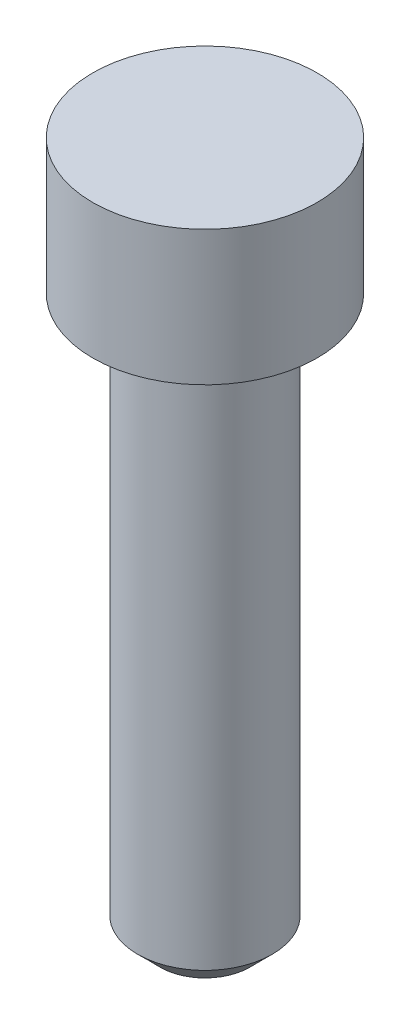
ISO-10303-21;
HEADER;
FILE_DESCRIPTION(('STEP AP214'),'2;1');
FILE_NAME('part.step','',(''),(''),'','','');
FILE_SCHEMA(('AUTOMOTIVE_DESIGN { 1 0 10303 214 1 1 1 1 }'));
ENDSEC;
DATA;
#1=APPLICATION_CONTEXT('core data for automotive mechanical design processes');
#2=APPLICATION_PROTOCOL_DEFINITION('international standard','automotive_design',2000,#1);
#3=PRODUCT_CONTEXT('',#1,'mechanical');
#4=PRODUCT('Part','Part','',(#3));
#5=PRODUCT_RELATED_PRODUCT_CATEGORY('part','',(#4));
#6=PRODUCT_DEFINITION_FORMATION('','',#4);
#7=PRODUCT_DEFINITION_CONTEXT('part definition',#1,'design');
#8=PRODUCT_DEFINITION('design','',#6,#7);
#9=PRODUCT_DEFINITION_SHAPE('','',#8);
#10=(LENGTH_UNIT() NAMED_UNIT(*) SI_UNIT(.MILLI.,.METRE.));
#11=(NAMED_UNIT(*) PLANE_ANGLE_UNIT() SI_UNIT($,.RADIAN.));
#12=(NAMED_UNIT(*) SI_UNIT($,.STERADIAN.) SOLID_ANGLE_UNIT());
#13=UNCERTAINTY_MEASURE_WITH_UNIT(LENGTH_MEASURE(1.E-05),#10,'distance_accuracy_value','');
#14=(GEOMETRIC_REPRESENTATION_CONTEXT(3) GLOBAL_UNCERTAINTY_ASSIGNED_CONTEXT((#13)) GLOBAL_UNIT_ASSIGNED_CONTEXT((#10,
#11,#12)) REPRESENTATION_CONTEXT('',''));
#15=CARTESIAN_POINT('',(0.,0.,0.));
#16=DIRECTION('',(0.,0.,1.));
#17=DIRECTION('',(1.,0.,0.));
#18=AXIS2_PLACEMENT_3D('',#15,#16,#17);
#19=CARTESIAN_POINT('',(0.,6.,0.));
#20=DIRECTION('',(0.,-1.,0.));
#21=DIRECTION('',(0.,0.,-1.));
#22=AXIS2_PLACEMENT_3D('',#19,#20,#21);
#23=CYLINDRICAL_SURFACE('',#22,5.);
#24=CARTESIAN_POINT('',(0.,6.,0.));
#25=DIRECTION('',(0.,1.,0.));
#26=DIRECTION('',(0.,0.,1.));
#27=AXIS2_PLACEMENT_3D('',#24,#25,#26);
#28=CIRCLE('',#27,5.);
#29=CARTESIAN_POINT('',(0.,6.,5.));
#30=VERTEX_POINT('',#29);
#31=EDGE_CURVE('E45',#30,#30,#28,.T.);
#32=ORIENTED_EDGE('',*,*,#31,.F.);
#33=EDGE_LOOP('',(#32));
#34=FACE_BOUND('',#33,.T.);
#35=CARTESIAN_POINT('',(0.,0.,0.));
#36=DIRECTION('',(0.,1.,0.));
#37=DIRECTION('',(0.,0.,1.));
#38=AXIS2_PLACEMENT_3D('',#35,#36,#37);
#39=CIRCLE('',#38,5.);
#40=CARTESIAN_POINT('',(0.,0.,5.));
#41=VERTEX_POINT('',#40);
#42=EDGE_CURVE('E48',#41,#41,#39,.T.);
#43=ORIENTED_EDGE('',*,*,#42,.T.);
#44=EDGE_LOOP('',(#43));
#45=FACE_BOUND('',#44,.T.);
#46=ADVANCED_FACE('F30',(#34,#45),#23,.T.);
#47=CARTESIAN_POINT('',(0.,6.,0.));
#48=DIRECTION('',(0.,1.,0.));
#49=DIRECTION('',(0.,0.,1.));
#50=AXIS2_PLACEMENT_3D('',#47,#48,#49);
#51=PLANE('',#50);
#52=ORIENTED_EDGE('',*,*,#31,.T.);
#53=EDGE_LOOP('',(#52));
#54=FACE_BOUND('',#53,.T.);
#55=ADVANCED_FACE('F54',(#54),#51,.T.);
#56=CARTESIAN_POINT('',(0.,0.,0.));
#57=DIRECTION('',(0.,1.,0.));
#58=DIRECTION('',(0.,0.,1.));
#59=AXIS2_PLACEMENT_3D('',#56,#57,#58);
#60=PLANE('',#59);
#61=CARTESIAN_POINT('',(0.,0.,0.));
#62=DIRECTION('',(0.,1.,0.));
#63=DIRECTION('',(0.,0.,1.));
#64=AXIS2_PLACEMENT_3D('',#61,#62,#63);
#65=CIRCLE('',#64,3.);
#66=CARTESIAN_POINT('',(0.,0.,3.));
#67=VERTEX_POINT('',#66);
#68=EDGE_CURVE('E41',#67,#67,#65,.F.);
#69=ORIENTED_EDGE('',*,*,#68,.F.);
#70=EDGE_LOOP('',(#69));
#71=FACE_BOUND('',#70,.T.);
#72=ORIENTED_EDGE('',*,*,#42,.F.);
#73=EDGE_LOOP('',(#72));
#74=FACE_BOUND('',#73,.T.);
#75=ADVANCED_FACE('F60',(#71,#74),#60,.F.);
#76=CARTESIAN_POINT('',(0.,-25.,0.));
#77=DIRECTION('',(0.,1.,0.));
#78=DIRECTION('',(0.,0.,1.));
#79=AXIS2_PLACEMENT_3D('',#76,#77,#78);
#80=CYLINDRICAL_SURFACE('',#79,3.);
#81=CARTESIAN_POINT('',(0.,-24.,0.));
#82=DIRECTION('',(0.,-1.,0.));
#83=DIRECTION('',(0.,0.,-1.));
#84=AXIS2_PLACEMENT_3D('',#81,#82,#83);
#85=CIRCLE('',#84,3.);
#86=CARTESIAN_POINT('',(0.,-24.,-3.));
#87=VERTEX_POINT('',#86);
#88=EDGE_CURVE('E10',#87,#87,#85,.F.);
#89=ORIENTED_EDGE('',*,*,#88,.T.);
#90=EDGE_LOOP('',(#89));
#91=FACE_BOUND('',#90,.T.);
#92=ORIENTED_EDGE('',*,*,#68,.T.);
#93=EDGE_LOOP('',(#92));
#94=FACE_BOUND('',#93,.T.);
#95=ADVANCED_FACE('F62',(#91,#94),#80,.T.);
#96=CARTESIAN_POINT('',(0.,-25.,0.));
#97=DIRECTION('',(0.,-1.,0.));
#98=DIRECTION('',(0.,0.,-1.));
#99=AXIS2_PLACEMENT_3D('',#96,#97,#98);
#100=PLANE('',#99);
#101=CARTESIAN_POINT('',(0.,-25.,0.));
#102=DIRECTION('',(0.,-1.,0.));
#103=DIRECTION('',(0.,0.,-1.));
#104=AXIS2_PLACEMENT_3D('',#101,#102,#103);
#105=CIRCLE('',#104,1.99999999999999);
#106=CARTESIAN_POINT('',(0.,-25.,-1.99999999999999));
#107=VERTEX_POINT('',#106);
#108=EDGE_CURVE('E37',#107,#107,#105,.T.);
#109=ORIENTED_EDGE('',*,*,#108,.T.);
#110=EDGE_LOOP('',(#109));
#111=FACE_BOUND('',#110,.T.);
#112=ADVANCED_FACE('F69',(#111),#100,.T.);
#113=CARTESIAN_POINT('',(0.,-25.,0.));
#114=DIRECTION('',(0.,1.,0.));
#115=DIRECTION('',(0.,0.,1.));
#116=AXIS2_PLACEMENT_3D('',#113,#114,#115);
#117=CONICAL_SURFACE('',#116,1.99999999999999,0.785398163397449);
#118=ORIENTED_EDGE('',*,*,#88,.F.);
#119=EDGE_LOOP('',(#118));
#120=FACE_BOUND('',#119,.T.);
#121=ORIENTED_EDGE('',*,*,#108,.F.);
#122=EDGE_LOOP('',(#121));
#123=FACE_BOUND('',#122,.T.);
#124=ADVANCED_FACE('F32',(#120,#123),#117,.T.);
#125=CLOSED_SHELL('',(#46,#55,#75,#95,#112,#124));
#126=MANIFOLD_SOLID_BREP('B2',#125);
#127=ADVANCED_BREP_SHAPE_REPRESENTATION('',(#18,#126),#14);
#128=SHAPE_DEFINITION_REPRESENTATION(#9,#127);
ENDSEC;
END-ISO-10303-21;
